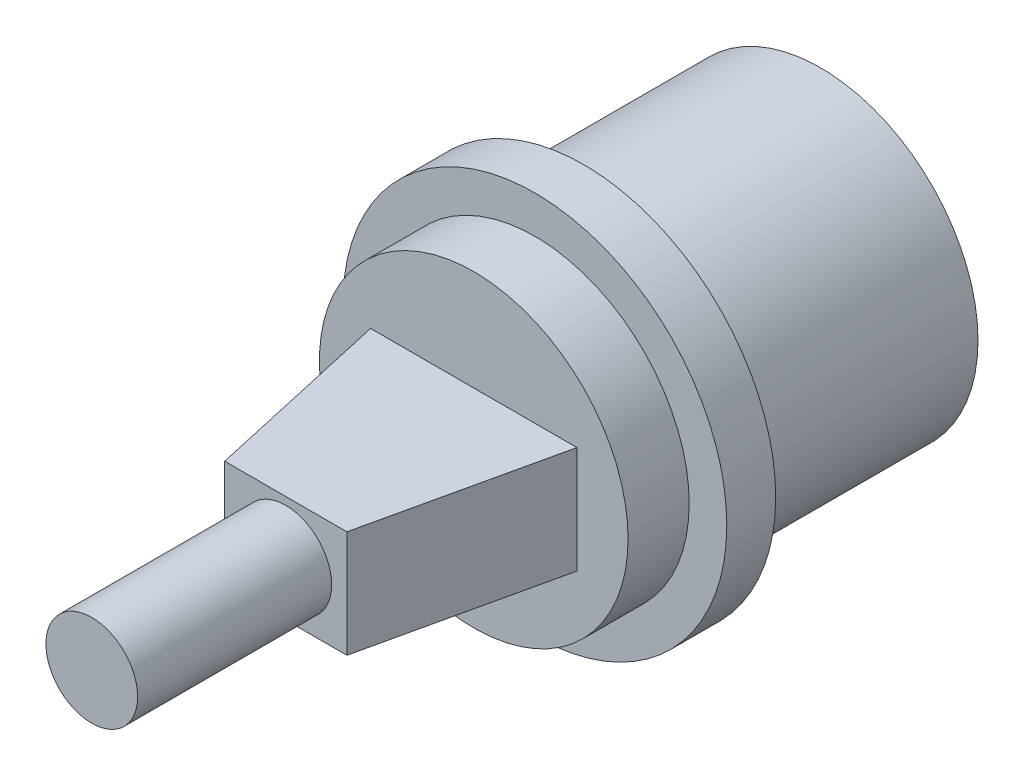
ISO-10303-21;
HEADER;
FILE_DESCRIPTION(('STEP AP214'),'2;1');
FILE_NAME('part.step','',(''),(''),'','','');
FILE_SCHEMA(('AUTOMOTIVE_DESIGN { 1 0 10303 214 1 1 1 1 }'));
ENDSEC;
DATA;
#1=APPLICATION_CONTEXT('core data for automotive mechanical design processes');
#2=APPLICATION_PROTOCOL_DEFINITION('international standard','automotive_design',2000,#1);
#3=PRODUCT_CONTEXT('',#1,'mechanical');
#4=PRODUCT('Part','Part','',(#3));
#5=PRODUCT_RELATED_PRODUCT_CATEGORY('part','',(#4));
#6=PRODUCT_DEFINITION_FORMATION('','',#4);
#7=PRODUCT_DEFINITION_CONTEXT('part definition',#1,'design');
#8=PRODUCT_DEFINITION('design','',#6,#7);
#9=PRODUCT_DEFINITION_SHAPE('','',#8);
#10=(LENGTH_UNIT() NAMED_UNIT(*) SI_UNIT(.MILLI.,.METRE.));
#11=(NAMED_UNIT(*) PLANE_ANGLE_UNIT() SI_UNIT($,.RADIAN.));
#12=(NAMED_UNIT(*) SI_UNIT($,.STERADIAN.) SOLID_ANGLE_UNIT());
#13=UNCERTAINTY_MEASURE_WITH_UNIT(LENGTH_MEASURE(1.E-05),#10,'distance_accuracy_value','');
#14=(GEOMETRIC_REPRESENTATION_CONTEXT(3) GLOBAL_UNCERTAINTY_ASSIGNED_CONTEXT((#13)) GLOBAL_UNIT_ASSIGNED_CONTEXT((#10,
#11,#12)) REPRESENTATION_CONTEXT('',''));
#15=CARTESIAN_POINT('',(0.,0.,0.));
#16=DIRECTION('',(0.,0.,1.));
#17=DIRECTION('',(1.,0.,0.));
#18=AXIS2_PLACEMENT_3D('',#15,#16,#17);
#19=CARTESIAN_POINT('',(0.,10.1,7.2));
#20=DIRECTION('',(0.,0.,-1.));
#21=DIRECTION('',(-1.,0.,0.));
#22=AXIS2_PLACEMENT_3D('',#19,#20,#21);
#23=PLANE('',#22);
#24=CARTESIAN_POINT('',(0.,0.,7.2));
#25=DIRECTION('',(0.,0.,1.));
#26=DIRECTION('',(1.,0.,0.));
#27=AXIS2_PLACEMENT_3D('',#24,#25,#26);
#28=CIRCLE('',#27,10.1);
#29=CARTESIAN_POINT('',(10.1,0.,7.2));
#30=VERTEX_POINT('',#29);
#31=EDGE_CURVE('E148',#30,#30,#28,.T.);
#32=ORIENTED_EDGE('',*,*,#31,.T.);
#33=EDGE_LOOP('',(#32));
#34=FACE_BOUND('',#33,.T.);
#35=DIRECTION('',(-1.,0.,0.));
#36=VECTOR('',#35,1.);
#37=CARTESIAN_POINT('',(-6.75,3.5,7.2));
#38=LINE('',#37,#36);
#39=CARTESIAN_POINT('',(6.75,3.5,7.2));
#40=VERTEX_POINT('',#39);
#41=CARTESIAN_POINT('',(-6.75,3.5,7.2));
#42=VERTEX_POINT('',#41);
#43=EDGE_CURVE('E167',#40,#42,#38,.T.);
#44=ORIENTED_EDGE('',*,*,#43,.F.);
#45=DIRECTION('',(0.,-1.,0.));
#46=VECTOR('',#45,1.);
#47=CARTESIAN_POINT('',(6.75,3.5,7.2));
#48=LINE('',#47,#46);
#49=CARTESIAN_POINT('',(6.75,-3.5,7.2));
#50=VERTEX_POINT('',#49);
#51=EDGE_CURVE('E161',#40,#50,#48,.T.);
#52=ORIENTED_EDGE('',*,*,#51,.T.);
#53=DIRECTION('',(-1.,0.,0.));
#54=VECTOR('',#53,1.);
#55=CARTESIAN_POINT('',(-6.75,-3.5,7.2));
#56=LINE('',#55,#54);
#57=CARTESIAN_POINT('',(-6.75,-3.5,7.2));
#58=VERTEX_POINT('',#57);
#59=EDGE_CURVE('E168',#50,#58,#56,.T.);
#60=ORIENTED_EDGE('',*,*,#59,.T.);
#61=DIRECTION('',(0.,-1.,0.));
#62=VECTOR('',#61,1.);
#63=CARTESIAN_POINT('',(-6.75,3.5,7.2));
#64=LINE('',#63,#62);
#65=EDGE_CURVE('E164',#42,#58,#64,.T.);
#66=ORIENTED_EDGE('',*,*,#65,.F.);
#67=EDGE_LOOP('',(#44,#52,#60,#66));
#68=FACE_BOUND('',#67,.T.);
#69=ADVANCED_FACE('F38',(#34,#68),#23,.F.);
#70=CARTESIAN_POINT('',(0.,0.,-15.5));
#71=DIRECTION('',(0.,0.,1.));
#72=DIRECTION('',(1.,0.,0.));
#73=AXIS2_PLACEMENT_3D('',#70,#71,#72);
#74=PLANE('',#73);
#75=DIRECTION('',(-1.,0.,0.));
#76=VECTOR('',#75,1.);
#77=CARTESIAN_POINT('',(-6.75000000000002,-3.00000000000001,-15.5));
#78=LINE('',#77,#76);
#79=CARTESIAN_POINT('',(6.74999999999998,-3.00000000000001,-15.5));
#80=VERTEX_POINT('',#79);
#81=CARTESIAN_POINT('',(-6.75000000000002,-3.00000000000001,-15.5));
#82=VERTEX_POINT('',#81);
#83=EDGE_CURVE('E204',#80,#82,#78,.T.);
#84=ORIENTED_EDGE('',*,*,#83,.F.);
#85=DIRECTION('',(0.,-1.,0.));
#86=VECTOR('',#85,1.);
#87=CARTESIAN_POINT('',(6.74999999999998,-3.00000000000001,-15.5));
#88=LINE('',#87,#86);
#89=CARTESIAN_POINT('',(6.74999999999998,2.99999999999999,-15.5));
#90=VERTEX_POINT('',#89);
#91=EDGE_CURVE('E60',#90,#80,#88,.T.);
#92=ORIENTED_EDGE('',*,*,#91,.F.);
#93=DIRECTION('',(1.,0.,0.));
#94=VECTOR('',#93,1.);
#95=CARTESIAN_POINT('',(-6.75000000000002,2.99999999999999,-15.5));
#96=LINE('',#95,#94);
#97=CARTESIAN_POINT('',(-6.75000000000002,2.99999999999999,-15.5));
#98=VERTEX_POINT('',#97);
#99=EDGE_CURVE('E196',#98,#90,#96,.T.);
#100=ORIENTED_EDGE('',*,*,#99,.F.);
#101=DIRECTION('',(0.,1.,0.));
#102=VECTOR('',#101,1.);
#103=CARTESIAN_POINT('',(-6.75000000000002,-3.00000000000001,-15.5));
#104=LINE('',#103,#102);
#105=EDGE_CURVE('E200',#82,#98,#104,.T.);
#106=ORIENTED_EDGE('',*,*,#105,.F.);
#107=EDGE_LOOP('',(#84,#92,#100,#106));
#108=FACE_BOUND('',#107,.T.);
#109=CARTESIAN_POINT('',(0.,0.,-15.5));
#110=DIRECTION('',(0.,0.,1.));
#111=DIRECTION('',(1.,0.,0.));
#112=AXIS2_PLACEMENT_3D('',#109,#110,#111);
#113=CIRCLE('',#112,10.3);
#114=CARTESIAN_POINT('',(-8.6,-5.66833308830736,-15.5));
#115=VERTEX_POINT('',#114);
#116=CARTESIAN_POINT('',(-8.6,5.66833308830736,-15.5));
#117=VERTEX_POINT('',#116);
#118=EDGE_CURVE('E46',#115,#117,#113,.T.);
#119=ORIENTED_EDGE('',*,*,#118,.F.);
#120=DIRECTION('',(0.,-1.,0.));
#121=VECTOR('',#120,1.);
#122=CARTESIAN_POINT('',(-8.6,5.66833308830736,-15.5));
#123=LINE('',#122,#121);
#124=EDGE_CURVE('E114',#117,#115,#123,.T.);
#125=ORIENTED_EDGE('',*,*,#124,.F.);
#126=EDGE_LOOP('',(#119,#125));
#127=FACE_BOUND('',#126,.T.);
#128=ADVANCED_FACE('F40',(#108,#127),#74,.F.);
#129=CARTESIAN_POINT('',(0.,0.,-15.5));
#130=DIRECTION('',(0.,0.,1.));
#131=DIRECTION('',(1.,0.,0.));
#132=AXIS2_PLACEMENT_3D('',#129,#130,#131);
#133=CYLINDRICAL_SURFACE('',#132,10.3);
#134=ORIENTED_EDGE('',*,*,#118,.T.);
#135=DIRECTION('',(0.,0.,-1.));
#136=VECTOR('',#135,1.);
#137=CARTESIAN_POINT('',(-8.6,5.66833308830736,11.4634200830293));
#138=LINE('',#137,#136);
#139=CARTESIAN_POINT('',(-8.6,5.66833308830736,0.));
#140=VERTEX_POINT('',#139);
#141=EDGE_CURVE('E120',#140,#117,#138,.T.);
#142=ORIENTED_EDGE('',*,*,#141,.F.);
#143=CARTESIAN_POINT('',(0.,0.,0.));
#144=DIRECTION('',(0.,0.,1.));
#145=DIRECTION('',(1.,0.,0.));
#146=AXIS2_PLACEMENT_3D('',#143,#144,#145);
#147=CIRCLE('',#146,10.3);
#148=CARTESIAN_POINT('',(-8.6,-5.66833308830736,0.));
#149=VERTEX_POINT('',#148);
#150=EDGE_CURVE('E128',#149,#140,#147,.T.);
#151=ORIENTED_EDGE('',*,*,#150,.F.);
#152=DIRECTION('',(0.,0.,-1.));
#153=VECTOR('',#152,1.);
#154=CARTESIAN_POINT('',(-8.6,-5.66833308830736,11.4634200830293));
#155=LINE('',#154,#153);
#156=EDGE_CURVE('E117',#149,#115,#155,.T.);
#157=ORIENTED_EDGE('',*,*,#156,.T.);
#158=EDGE_LOOP('',(#134,#142,#151,#157));
#159=FACE_BOUND('',#158,.T.);
#160=ADVANCED_FACE('F127',(#159),#133,.T.);
#161=CARTESIAN_POINT('',(0.,10.3,0.));
#162=DIRECTION('',(0.,0.,1.));
#163=DIRECTION('',(1.,0.,0.));
#164=AXIS2_PLACEMENT_3D('',#161,#162,#163);
#165=PLANE('',#164);
#166=CARTESIAN_POINT('',(0.,0.,0.));
#167=DIRECTION('',(0.,0.,1.));
#168=DIRECTION('',(1.,0.,0.));
#169=AXIS2_PLACEMENT_3D('',#166,#167,#168);
#170=CIRCLE('',#169,12.56);
#171=CARTESIAN_POINT('',(12.56,0.,0.));
#172=VERTEX_POINT('',#171);
#173=EDGE_CURVE('E136',#172,#172,#170,.T.);
#174=ORIENTED_EDGE('',*,*,#173,.F.);
#175=EDGE_LOOP('',(#174));
#176=FACE_BOUND('',#175,.T.);
#177=ORIENTED_EDGE('',*,*,#150,.T.);
#178=DIRECTION('',(0.,-1.,0.));
#179=VECTOR('',#178,1.);
#180=CARTESIAN_POINT('',(-8.6,5.66833308830736,0.));
#181=LINE('',#180,#179);
#182=EDGE_CURVE('E52',#140,#149,#181,.T.);
#183=ORIENTED_EDGE('',*,*,#182,.T.);
#184=EDGE_LOOP('',(#177,#183));
#185=FACE_BOUND('',#184,.T.);
#186=ADVANCED_FACE('F234',(#176,#185),#165,.F.);
#187=CARTESIAN_POINT('',(0.,0.,-15.5));
#188=DIRECTION('',(0.,0.,1.));
#189=DIRECTION('',(1.,0.,0.));
#190=AXIS2_PLACEMENT_3D('',#187,#188,#189);
#191=CYLINDRICAL_SURFACE('',#190,12.56);
#192=CARTESIAN_POINT('',(0.,0.,3.2));
#193=DIRECTION('',(0.,0.,1.));
#194=DIRECTION('',(1.,0.,0.));
#195=AXIS2_PLACEMENT_3D('',#192,#193,#194);
#196=CIRCLE('',#195,12.56);
#197=CARTESIAN_POINT('',(12.56,0.,3.2));
#198=VERTEX_POINT('',#197);
#199=EDGE_CURVE('E141',#198,#198,#196,.T.);
#200=ORIENTED_EDGE('',*,*,#199,.F.);
#201=EDGE_LOOP('',(#200));
#202=FACE_BOUND('',#201,.T.);
#203=ORIENTED_EDGE('',*,*,#173,.T.);
#204=EDGE_LOOP('',(#203));
#205=FACE_BOUND('',#204,.T.);
#206=ADVANCED_FACE('F243',(#202,#205),#191,.T.);
#207=CARTESIAN_POINT('',(0.,12.56,3.2));
#208=DIRECTION('',(0.,0.,-1.));
#209=DIRECTION('',(-1.,0.,0.));
#210=AXIS2_PLACEMENT_3D('',#207,#208,#209);
#211=PLANE('',#210);
#212=CARTESIAN_POINT('',(0.,0.,3.2));
#213=DIRECTION('',(0.,0.,1.));
#214=DIRECTION('',(1.,0.,0.));
#215=AXIS2_PLACEMENT_3D('',#212,#213,#214);
#216=CIRCLE('',#215,10.1);
#217=CARTESIAN_POINT('',(10.1,0.,3.2));
#218=VERTEX_POINT('',#217);
#219=EDGE_CURVE('E144',#218,#218,#216,.T.);
#220=ORIENTED_EDGE('',*,*,#219,.F.);
#221=EDGE_LOOP('',(#220));
#222=FACE_BOUND('',#221,.T.);
#223=ORIENTED_EDGE('',*,*,#199,.T.);
#224=EDGE_LOOP('',(#223));
#225=FACE_BOUND('',#224,.T.);
#226=ADVANCED_FACE('F360',(#222,#225),#211,.F.);
#227=CARTESIAN_POINT('',(0.,0.,-15.5));
#228=DIRECTION('',(0.,0.,1.));
#229=DIRECTION('',(1.,0.,0.));
#230=AXIS2_PLACEMENT_3D('',#227,#228,#229);
#231=CYLINDRICAL_SURFACE('',#230,10.1);
#232=ORIENTED_EDGE('',*,*,#31,.F.);
#233=EDGE_LOOP('',(#232));
#234=FACE_BOUND('',#233,.T.);
#235=ORIENTED_EDGE('',*,*,#219,.T.);
#236=EDGE_LOOP('',(#235));
#237=FACE_BOUND('',#236,.T.);
#238=ADVANCED_FACE('F353',(#234,#237),#231,.T.);
#239=CARTESIAN_POINT('',(-4.,3.5,19.5));
#240=DIRECTION('',(0.975906216364603,0.,-0.218190414227858));
#241=DIRECTION('',(-0.218190414227858,0.,-0.975906216364603));
#242=AXIS2_PLACEMENT_3D('',#239,#240,#241);
#243=PLANE('',#242);
#244=DIRECTION('',(0.218190414227858,0.,0.975906216364603));
#245=VECTOR('',#244,1.);
#246=CARTESIAN_POINT('',(-4.,-3.5,19.5));
#247=LINE('',#246,#245);
#248=CARTESIAN_POINT('',(-4.,-3.5,19.5));
#249=VERTEX_POINT('',#248);
#250=EDGE_CURVE('E177',#58,#249,#247,.T.);
#251=ORIENTED_EDGE('',*,*,#250,.T.);
#252=DIRECTION('',(0.,-1.,0.));
#253=VECTOR('',#252,1.);
#254=CARTESIAN_POINT('',(-4.,3.5,19.5));
#255=LINE('',#254,#253);
#256=CARTESIAN_POINT('',(-4.,3.5,19.5));
#257=VERTEX_POINT('',#256);
#258=EDGE_CURVE('E155',#257,#249,#255,.T.);
#259=ORIENTED_EDGE('',*,*,#258,.F.);
#260=DIRECTION('',(0.218190414227858,0.,0.975906216364603));
#261=VECTOR('',#260,1.);
#262=CARTESIAN_POINT('',(-4.,3.5,19.5));
#263=LINE('',#262,#261);
#264=EDGE_CURVE('E171',#42,#257,#263,.T.);
#265=ORIENTED_EDGE('',*,*,#264,.F.);
#266=ORIENTED_EDGE('',*,*,#65,.T.);
#267=EDGE_LOOP('',(#251,#259,#265,#266));
#268=FACE_BOUND('',#267,.T.);
#269=ADVANCED_FACE('F345',(#268),#243,.F.);
#270=CARTESIAN_POINT('',(4.,3.5,19.5));
#271=DIRECTION('',(0.,0.,-1.));
#272=DIRECTION('',(-1.,0.,0.));
#273=AXIS2_PLACEMENT_3D('',#270,#271,#272);
#274=PLANE('',#273);
#275=CARTESIAN_POINT('',(0.,0.,19.5));
#276=DIRECTION('',(0.,0.,-1.));
#277=DIRECTION('',(-1.,0.,0.));
#278=AXIS2_PLACEMENT_3D('',#275,#276,#277);
#279=CIRCLE('',#278,3.);
#280=CARTESIAN_POINT('',(-3.,0.,19.5));
#281=VERTEX_POINT('',#280);
#282=EDGE_CURVE('E11',#281,#281,#279,.T.);
#283=ORIENTED_EDGE('',*,*,#282,.T.);
#284=EDGE_LOOP('',(#283));
#285=FACE_BOUND('',#284,.T.);
#286=DIRECTION('',(1.,0.,0.));
#287=VECTOR('',#286,1.);
#288=CARTESIAN_POINT('',(4.,-3.5,19.5));
#289=LINE('',#288,#287);
#290=CARTESIAN_POINT('',(4.,-3.5,19.5));
#291=VERTEX_POINT('',#290);
#292=EDGE_CURVE('E175',#249,#291,#289,.T.);
#293=ORIENTED_EDGE('',*,*,#292,.T.);
#294=DIRECTION('',(0.,-1.,0.));
#295=VECTOR('',#294,1.);
#296=CARTESIAN_POINT('',(4.,3.5,19.5));
#297=LINE('',#296,#295);
#298=CARTESIAN_POINT('',(4.,3.5,19.5));
#299=VERTEX_POINT('',#298);
#300=EDGE_CURVE('E158',#299,#291,#297,.T.);
#301=ORIENTED_EDGE('',*,*,#300,.F.);
#302=DIRECTION('',(1.,0.,0.));
#303=VECTOR('',#302,1.);
#304=CARTESIAN_POINT('',(4.,3.5,19.5));
#305=LINE('',#304,#303);
#306=EDGE_CURVE('E184',#257,#299,#305,.T.);
#307=ORIENTED_EDGE('',*,*,#306,.F.);
#308=ORIENTED_EDGE('',*,*,#258,.T.);
#309=EDGE_LOOP('',(#293,#301,#307,#308));
#310=FACE_BOUND('',#309,.T.);
#311=ADVANCED_FACE('F337',(#285,#310),#274,.F.);
#312=CARTESIAN_POINT('',(6.75,3.5,7.2));
#313=DIRECTION('',(-0.975906216364603,0.,-0.218190414227858));
#314=DIRECTION('',(-0.218190414227858,0.,0.975906216364603));
#315=AXIS2_PLACEMENT_3D('',#312,#313,#314);
#316=PLANE('',#315);
#317=DIRECTION('',(0.218190414227858,0.,-0.975906216364603));
#318=VECTOR('',#317,1.);
#319=CARTESIAN_POINT('',(6.75,-3.5,7.2));
#320=LINE('',#319,#318);
#321=EDGE_CURVE('E172',#291,#50,#320,.T.);
#322=ORIENTED_EDGE('',*,*,#321,.T.);
#323=ORIENTED_EDGE('',*,*,#51,.F.);
#324=DIRECTION('',(0.218190414227858,0.,-0.975906216364603));
#325=VECTOR('',#324,1.);
#326=CARTESIAN_POINT('',(6.75,3.5,7.2));
#327=LINE('',#326,#325);
#328=EDGE_CURVE('E182',#299,#40,#327,.T.);
#329=ORIENTED_EDGE('',*,*,#328,.F.);
#330=ORIENTED_EDGE('',*,*,#300,.T.);
#331=EDGE_LOOP('',(#322,#323,#329,#330));
#332=FACE_BOUND('',#331,.T.);
#333=ADVANCED_FACE('F329',(#332),#316,.F.);
#334=CARTESIAN_POINT('',(0.,3.5,0.));
#335=DIRECTION('',(0.,-1.,0.));
#336=DIRECTION('',(0.,0.,-1.));
#337=AXIS2_PLACEMENT_3D('',#334,#335,#336);
#338=PLANE('',#337);
#339=ORIENTED_EDGE('',*,*,#264,.T.);
#340=ORIENTED_EDGE('',*,*,#306,.T.);
#341=ORIENTED_EDGE('',*,*,#328,.T.);
#342=ORIENTED_EDGE('',*,*,#43,.T.);
#343=EDGE_LOOP('',(#339,#340,#341,#342));
#344=FACE_BOUND('',#343,.T.);
#345=ADVANCED_FACE('F321',(#344),#338,.F.);
#346=CARTESIAN_POINT('',(0.,-3.5,0.));
#347=DIRECTION('',(0.,-1.,0.));
#348=DIRECTION('',(0.,0.,-1.));
#349=AXIS2_PLACEMENT_3D('',#346,#347,#348);
#350=PLANE('',#349);
#351=ORIENTED_EDGE('',*,*,#250,.F.);
#352=ORIENTED_EDGE('',*,*,#59,.F.);
#353=ORIENTED_EDGE('',*,*,#321,.F.);
#354=ORIENTED_EDGE('',*,*,#292,.F.);
#355=EDGE_LOOP('',(#351,#352,#353,#354));
#356=FACE_BOUND('',#355,.T.);
#357=ADVANCED_FACE('F312',(#356),#350,.T.);
#358=CARTESIAN_POINT('',(0.,3.,32.2));
#359=DIRECTION('',(0.,0.,-1.));
#360=DIRECTION('',(-1.,0.,0.));
#361=AXIS2_PLACEMENT_3D('',#358,#359,#360);
#362=PLANE('',#361);
#363=CARTESIAN_POINT('',(0.,0.,32.2));
#364=DIRECTION('',(0.,0.,1.));
#365=DIRECTION('',(1.,0.,0.));
#366=AXIS2_PLACEMENT_3D('',#363,#364,#365);
#367=CIRCLE('',#366,3.);
#368=CARTESIAN_POINT('',(3.,0.,32.2));
#369=VERTEX_POINT('',#368);
#370=EDGE_CURVE('E152',#369,#369,#367,.T.);
#371=ORIENTED_EDGE('',*,*,#370,.T.);
#372=EDGE_LOOP('',(#371));
#373=FACE_BOUND('',#372,.T.);
#374=ADVANCED_FACE('F303',(#373),#362,.F.);
#375=CARTESIAN_POINT('',(0.,0.,-15.5));
#376=DIRECTION('',(0.,0.,1.));
#377=DIRECTION('',(1.,0.,0.));
#378=AXIS2_PLACEMENT_3D('',#375,#376,#377);
#379=CYLINDRICAL_SURFACE('',#378,3.);
#380=ORIENTED_EDGE('',*,*,#370,.F.);
#381=EDGE_LOOP('',(#380));
#382=FACE_BOUND('',#381,.T.);
#383=ORIENTED_EDGE('',*,*,#282,.F.);
#384=EDGE_LOOP('',(#383));
#385=FACE_BOUND('',#384,.T.);
#386=ADVANCED_FACE('F296',(#382,#385),#379,.T.);
#387=CARTESIAN_POINT('',(6.74999999999998,-3.00000000000001,-5.5));
#388=DIRECTION('',(1.,0.,0.));
#389=DIRECTION('',(0.,0.,-1.));
#390=AXIS2_PLACEMENT_3D('',#387,#388,#389);
#391=PLANE('',#390);
#392=ORIENTED_EDGE('',*,*,#91,.T.);
#393=DIRECTION('',(0.,0.,-1.));
#394=VECTOR('',#393,1.);
#395=CARTESIAN_POINT('',(6.74999999999998,-3.00000000000001,-5.5));
#396=LINE('',#395,#394);
#397=CARTESIAN_POINT('',(6.74999999999998,-3.00000000000001,-5.5));
#398=VERTEX_POINT('',#397);
#399=EDGE_CURVE('E188',#398,#80,#396,.T.);
#400=ORIENTED_EDGE('',*,*,#399,.F.);
#401=DIRECTION('',(0.,-1.,0.));
#402=VECTOR('',#401,1.);
#403=CARTESIAN_POINT('',(6.74999999999998,-3.00000000000001,-5.5));
#404=LINE('',#403,#402);
#405=CARTESIAN_POINT('',(6.74999999999998,2.99999999999999,-5.5));
#406=VERTEX_POINT('',#405);
#407=EDGE_CURVE('E199',#406,#398,#404,.T.);
#408=ORIENTED_EDGE('',*,*,#407,.F.);
#409=DIRECTION('',(0.,0.,-1.));
#410=VECTOR('',#409,1.);
#411=CARTESIAN_POINT('',(6.74999999999998,2.99999999999999,-5.5));
#412=LINE('',#411,#410);
#413=EDGE_CURVE('E180',#406,#90,#412,.T.);
#414=ORIENTED_EDGE('',*,*,#413,.T.);
#415=EDGE_LOOP('',(#392,#400,#408,#414));
#416=FACE_BOUND('',#415,.T.);
#417=ADVANCED_FACE('F288',(#416),#391,.F.);
#418=CARTESIAN_POINT('',(-6.75000000000002,2.99999999999999,-5.5));
#419=DIRECTION('',(0.,1.,0.));
#420=DIRECTION('',(-1.,0.,0.));
#421=AXIS2_PLACEMENT_3D('',#418,#419,#420);
#422=PLANE('',#421);
#423=ORIENTED_EDGE('',*,*,#99,.T.);
#424=ORIENTED_EDGE('',*,*,#413,.F.);
#425=DIRECTION('',(1.,0.,0.));
#426=VECTOR('',#425,1.);
#427=CARTESIAN_POINT('',(-6.75000000000002,2.99999999999999,-5.5));
#428=LINE('',#427,#426);
#429=CARTESIAN_POINT('',(-6.75000000000002,2.99999999999999,-5.5));
#430=VERTEX_POINT('',#429);
#431=EDGE_CURVE('E191',#430,#406,#428,.T.);
#432=ORIENTED_EDGE('',*,*,#431,.F.);
#433=DIRECTION('',(0.,0.,-1.));
#434=VECTOR('',#433,1.);
#435=CARTESIAN_POINT('',(-6.75000000000002,2.99999999999999,-5.5));
#436=LINE('',#435,#434);
#437=EDGE_CURVE('E193',#430,#98,#436,.T.);
#438=ORIENTED_EDGE('',*,*,#437,.T.);
#439=EDGE_LOOP('',(#423,#424,#432,#438));
#440=FACE_BOUND('',#439,.T.);
#441=ADVANCED_FACE('F280',(#440),#422,.F.);
#442=CARTESIAN_POINT('',(-6.75000000000002,-3.00000000000001,-5.5));
#443=DIRECTION('',(-1.,0.,0.));
#444=DIRECTION('',(0.,0.,1.));
#445=AXIS2_PLACEMENT_3D('',#442,#443,#444);
#446=PLANE('',#445);
#447=ORIENTED_EDGE('',*,*,#105,.T.);
#448=ORIENTED_EDGE('',*,*,#437,.F.);
#449=DIRECTION('',(0.,1.,0.));
#450=VECTOR('',#449,1.);
#451=CARTESIAN_POINT('',(-6.75000000000002,-3.00000000000001,-5.5));
#452=LINE('',#451,#450);
#453=CARTESIAN_POINT('',(-6.75000000000002,-3.00000000000001,-5.5));
#454=VERTEX_POINT('',#453);
#455=EDGE_CURVE('E210',#454,#430,#452,.T.);
#456=ORIENTED_EDGE('',*,*,#455,.F.);
#457=DIRECTION('',(0.,0.,-1.));
#458=VECTOR('',#457,1.);
#459=CARTESIAN_POINT('',(-6.75000000000002,-3.00000000000001,-5.5));
#460=LINE('',#459,#458);
#461=EDGE_CURVE('E190',#454,#82,#460,.T.);
#462=ORIENTED_EDGE('',*,*,#461,.T.);
#463=EDGE_LOOP('',(#447,#448,#456,#462));
#464=FACE_BOUND('',#463,.T.);
#465=ADVANCED_FACE('F272',(#464),#446,.F.);
#466=CARTESIAN_POINT('',(-6.75000000000002,-3.00000000000001,-5.5));
#467=DIRECTION('',(0.,-1.,0.));
#468=DIRECTION('',(1.,0.,0.));
#469=AXIS2_PLACEMENT_3D('',#466,#467,#468);
#470=PLANE('',#469);
#471=ORIENTED_EDGE('',*,*,#83,.T.);
#472=ORIENTED_EDGE('',*,*,#461,.F.);
#473=DIRECTION('',(-1.,0.,0.));
#474=VECTOR('',#473,1.);
#475=CARTESIAN_POINT('',(-6.75000000000002,-3.00000000000001,-5.5));
#476=LINE('',#475,#474);
#477=EDGE_CURVE('E213',#398,#454,#476,.T.);
#478=ORIENTED_EDGE('',*,*,#477,.F.);
#479=ORIENTED_EDGE('',*,*,#399,.T.);
#480=EDGE_LOOP('',(#471,#472,#478,#479));
#481=FACE_BOUND('',#480,.T.);
#482=ADVANCED_FACE('F264',(#481),#470,.F.);
#483=CARTESIAN_POINT('',(0.,0.,-5.5));
#484=DIRECTION('',(0.,0.,-1.));
#485=DIRECTION('',(-1.,0.,0.));
#486=AXIS2_PLACEMENT_3D('',#483,#484,#485);
#487=PLANE('',#486);
#488=ORIENTED_EDGE('',*,*,#407,.T.);
#489=ORIENTED_EDGE('',*,*,#477,.T.);
#490=ORIENTED_EDGE('',*,*,#455,.T.);
#491=ORIENTED_EDGE('',*,*,#431,.T.);
#492=EDGE_LOOP('',(#488,#489,#490,#491));
#493=FACE_BOUND('',#492,.T.);
#494=ADVANCED_FACE('F255',(#493),#487,.T.);
#495=CARTESIAN_POINT('',(-8.6,5.66833308830736,11.4634200830293));
#496=DIRECTION('',(1.,0.,0.));
#497=DIRECTION('',(0.,0.,-1.));
#498=AXIS2_PLACEMENT_3D('',#495,#496,#497);
#499=PLANE('',#498);
#500=ORIENTED_EDGE('',*,*,#141,.T.);
#501=ORIENTED_EDGE('',*,*,#124,.T.);
#502=ORIENTED_EDGE('',*,*,#156,.F.);
#503=ORIENTED_EDGE('',*,*,#182,.F.);
#504=EDGE_LOOP('',(#500,#501,#502,#503));
#505=FACE_BOUND('',#504,.T.);
#506=ADVANCED_FACE('F116',(#505),#499,.F.);
#507=CLOSED_SHELL('',(#69,#128,#160,#186,#206,#226,#238,#269,#311,#333,#345,#357,#374,#386,#417,
#441,#465,#482,#494,#506));
#508=MANIFOLD_SOLID_BREP('B2',#507);
#509=ADVANCED_BREP_SHAPE_REPRESENTATION('',(#18,#508),#14);
#510=SHAPE_DEFINITION_REPRESENTATION(#9,#509);
ENDSEC;
END-ISO-10303-21;
